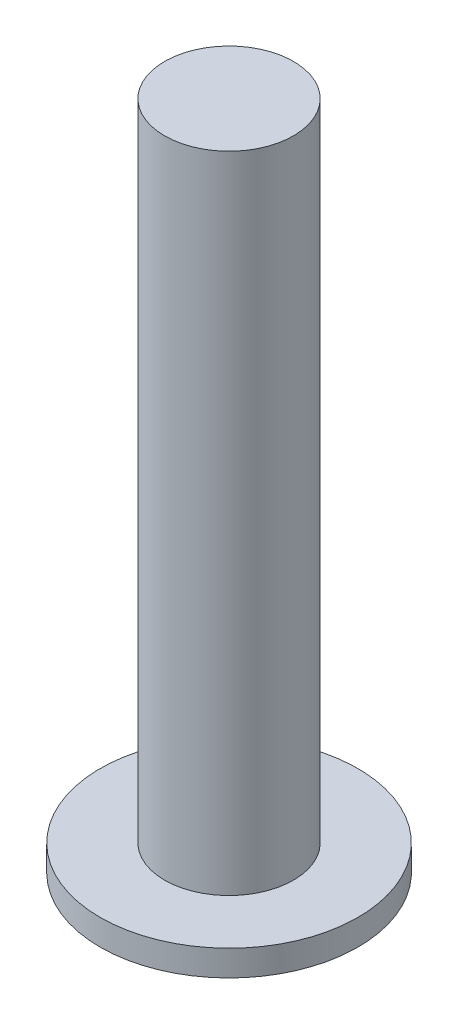
ISO-10303-21;
HEADER;
FILE_DESCRIPTION(('STEP AP214'),'2;1');
FILE_NAME('part.step','',(''),(''),'','','');
FILE_SCHEMA(('AUTOMOTIVE_DESIGN { 1 0 10303 214 1 1 1 1 }'));
ENDSEC;
DATA;
#1=APPLICATION_CONTEXT('core data for automotive mechanical design processes');
#2=APPLICATION_PROTOCOL_DEFINITION('international standard','automotive_design',2000,#1);
#3=PRODUCT_CONTEXT('',#1,'mechanical');
#4=PRODUCT('Part','Part','',(#3));
#5=PRODUCT_RELATED_PRODUCT_CATEGORY('part','',(#4));
#6=PRODUCT_DEFINITION_FORMATION('','',#4);
#7=PRODUCT_DEFINITION_CONTEXT('part definition',#1,'design');
#8=PRODUCT_DEFINITION('design','',#6,#7);
#9=PRODUCT_DEFINITION_SHAPE('','',#8);
#10=(LENGTH_UNIT() NAMED_UNIT(*) SI_UNIT(.MILLI.,.METRE.));
#11=(NAMED_UNIT(*) PLANE_ANGLE_UNIT() SI_UNIT($,.RADIAN.));
#12=(NAMED_UNIT(*) SI_UNIT($,.STERADIAN.) SOLID_ANGLE_UNIT());
#13=UNCERTAINTY_MEASURE_WITH_UNIT(LENGTH_MEASURE(1.E-05),#10,'distance_accuracy_value','');
#14=(GEOMETRIC_REPRESENTATION_CONTEXT(3) GLOBAL_UNCERTAINTY_ASSIGNED_CONTEXT((#13)) GLOBAL_UNIT_ASSIGNED_CONTEXT((#10,
#11,#12)) REPRESENTATION_CONTEXT('',''));
#15=CARTESIAN_POINT('',(0.,0.,0.));
#16=DIRECTION('',(0.,0.,1.));
#17=DIRECTION('',(1.,0.,0.));
#18=AXIS2_PLACEMENT_3D('',#15,#16,#17);
#19=CARTESIAN_POINT('',(0.,10.,0.));
#20=DIRECTION('',(0.,-1.,0.));
#21=DIRECTION('',(0.,0.,-1.));
#22=AXIS2_PLACEMENT_3D('',#19,#20,#21);
#23=CYLINDRICAL_SURFACE('',#22,50.);
#24=CARTESIAN_POINT('',(0.,10.,0.));
#25=DIRECTION('',(0.,1.,0.));
#26=DIRECTION('',(0.,0.,1.));
#27=AXIS2_PLACEMENT_3D('',#24,#25,#26);
#28=CIRCLE('',#27,50.);
#29=CARTESIAN_POINT('',(0.,10.,50.));
#30=VERTEX_POINT('',#29);
#31=EDGE_CURVE('E38',#30,#30,#28,.T.);
#32=ORIENTED_EDGE('',*,*,#31,.F.);
#33=EDGE_LOOP('',(#32));
#34=FACE_BOUND('',#33,.T.);
#35=CARTESIAN_POINT('',(0.,0.,0.));
#36=DIRECTION('',(0.,1.,0.));
#37=DIRECTION('',(0.,0.,1.));
#38=AXIS2_PLACEMENT_3D('',#35,#36,#37);
#39=CIRCLE('',#38,50.);
#40=CARTESIAN_POINT('',(0.,0.,50.));
#41=VERTEX_POINT('',#40);
#42=EDGE_CURVE('E34',#41,#41,#39,.T.);
#43=ORIENTED_EDGE('',*,*,#42,.T.);
#44=EDGE_LOOP('',(#43));
#45=FACE_BOUND('',#44,.T.);
#46=ADVANCED_FACE('F31',(#34,#45),#23,.T.);
#47=CARTESIAN_POINT('',(0.,10.,0.));
#48=DIRECTION('',(0.,1.,0.));
#49=DIRECTION('',(0.,0.,1.));
#50=AXIS2_PLACEMENT_3D('',#47,#48,#49);
#51=PLANE('',#50);
#52=CARTESIAN_POINT('',(0.,10.,0.));
#53=DIRECTION('',(0.,1.,0.));
#54=DIRECTION('',(0.,0.,1.));
#55=AXIS2_PLACEMENT_3D('',#52,#53,#54);
#56=CIRCLE('',#55,25.);
#57=CARTESIAN_POINT('',(0.,10.,25.));
#58=VERTEX_POINT('',#57);
#59=EDGE_CURVE('E10',#58,#58,#56,.T.);
#60=ORIENTED_EDGE('',*,*,#59,.F.);
#61=EDGE_LOOP('',(#60));
#62=FACE_BOUND('',#61,.T.);
#63=ORIENTED_EDGE('',*,*,#31,.T.);
#64=EDGE_LOOP('',(#63));
#65=FACE_BOUND('',#64,.T.);
#66=ADVANCED_FACE('F55',(#62,#65),#51,.T.);
#67=CARTESIAN_POINT('',(0.,0.,0.));
#68=DIRECTION('',(0.,1.,0.));
#69=DIRECTION('',(0.,0.,1.));
#70=AXIS2_PLACEMENT_3D('',#67,#68,#69);
#71=PLANE('',#70);
#72=ORIENTED_EDGE('',*,*,#42,.F.);
#73=EDGE_LOOP('',(#72));
#74=FACE_BOUND('',#73,.T.);
#75=ADVANCED_FACE('F52',(#74),#71,.F.);
#76=CARTESIAN_POINT('',(0.,260.,0.));
#77=DIRECTION('',(0.,-1.,0.));
#78=DIRECTION('',(0.,0.,-1.));
#79=AXIS2_PLACEMENT_3D('',#76,#77,#78);
#80=CYLINDRICAL_SURFACE('',#79,25.);
#81=CARTESIAN_POINT('',(0.,260.,0.));
#82=DIRECTION('',(0.,1.,0.));
#83=DIRECTION('',(0.,0.,1.));
#84=AXIS2_PLACEMENT_3D('',#81,#82,#83);
#85=CIRCLE('',#84,25.);
#86=CARTESIAN_POINT('',(0.,260.,25.));
#87=VERTEX_POINT('',#86);
#88=EDGE_CURVE('E44',#87,#87,#85,.T.);
#89=ORIENTED_EDGE('',*,*,#88,.F.);
#90=EDGE_LOOP('',(#89));
#91=FACE_BOUND('',#90,.T.);
#92=ORIENTED_EDGE('',*,*,#59,.T.);
#93=EDGE_LOOP('',(#92));
#94=FACE_BOUND('',#93,.T.);
#95=ADVANCED_FACE('F54',(#91,#94),#80,.T.);
#96=CARTESIAN_POINT('',(0.,260.,0.));
#97=DIRECTION('',(0.,1.,0.));
#98=DIRECTION('',(0.,0.,1.));
#99=AXIS2_PLACEMENT_3D('',#96,#97,#98);
#100=PLANE('',#99);
#101=ORIENTED_EDGE('',*,*,#88,.T.);
#102=EDGE_LOOP('',(#101));
#103=FACE_BOUND('',#102,.T.);
#104=ADVANCED_FACE('F60',(#103),#100,.T.);
#105=CLOSED_SHELL('',(#46,#66,#75,#95,#104));
#106=MANIFOLD_SOLID_BREP('B2',#105);
#107=ADVANCED_BREP_SHAPE_REPRESENTATION('',(#18,#106),#14);
#108=SHAPE_DEFINITION_REPRESENTATION(#9,#107);
ENDSEC;
END-ISO-10303-21;
